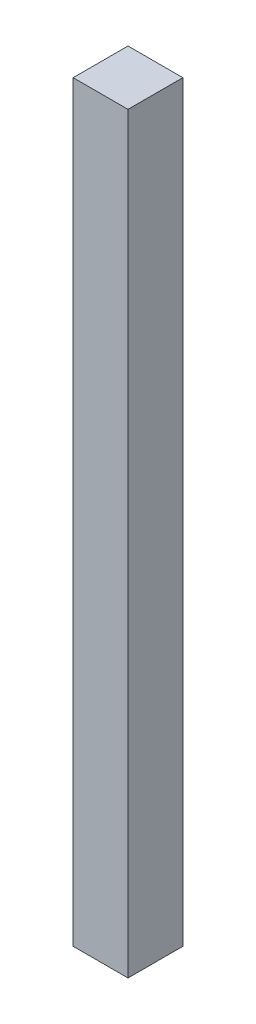
ISO-10303-21;
HEADER;
FILE_DESCRIPTION(('STEP AP214'),'2;1');
FILE_NAME('part.step','',(''),(''),'','','');
FILE_SCHEMA(('AUTOMOTIVE_DESIGN { 1 0 10303 214 1 1 1 1 }'));
ENDSEC;
DATA;
#1=APPLICATION_CONTEXT('core data for automotive mechanical design processes');
#2=APPLICATION_PROTOCOL_DEFINITION('international standard','automotive_design',2000,#1);
#3=PRODUCT_CONTEXT('',#1,'mechanical');
#4=PRODUCT('Part','Part','',(#3));
#5=PRODUCT_RELATED_PRODUCT_CATEGORY('part','',(#4));
#6=PRODUCT_DEFINITION_FORMATION('','',#4);
#7=PRODUCT_DEFINITION_CONTEXT('part definition',#1,'design');
#8=PRODUCT_DEFINITION('design','',#6,#7);
#9=PRODUCT_DEFINITION_SHAPE('','',#8);
#10=(LENGTH_UNIT() NAMED_UNIT(*) SI_UNIT(.MILLI.,.METRE.));
#11=(NAMED_UNIT(*) PLANE_ANGLE_UNIT() SI_UNIT($,.RADIAN.));
#12=(NAMED_UNIT(*) SI_UNIT($,.STERADIAN.) SOLID_ANGLE_UNIT());
#13=UNCERTAINTY_MEASURE_WITH_UNIT(LENGTH_MEASURE(1.E-05),#10,'distance_accuracy_value','');
#14=(GEOMETRIC_REPRESENTATION_CONTEXT(3) GLOBAL_UNCERTAINTY_ASSIGNED_CONTEXT((#13)) GLOBAL_UNIT_ASSIGNED_CONTEXT((#10,
#11,#12)) REPRESENTATION_CONTEXT('',''));
#15=CARTESIAN_POINT('',(0.,0.,0.));
#16=DIRECTION('',(0.,0.,1.));
#17=DIRECTION('',(1.,0.,0.));
#18=AXIS2_PLACEMENT_3D('',#15,#16,#17);
#19=CARTESIAN_POINT('',(0.,-1219.2,88.9));
#20=DIRECTION('',(1.,0.,0.));
#21=DIRECTION('',(0.,0.,-1.));
#22=AXIS2_PLACEMENT_3D('',#19,#20,#21);
#23=PLANE('',#22);
#24=DIRECTION('',(0.,0.,-1.));
#25=VECTOR('',#24,1.);
#26=CARTESIAN_POINT('',(0.,0.,88.9));
#27=LINE('',#26,#25);
#28=CARTESIAN_POINT('',(0.,0.,88.9));
#29=VERTEX_POINT('',#28);
#30=CARTESIAN_POINT('',(0.,0.,0.));
#31=VERTEX_POINT('',#30);
#32=EDGE_CURVE('E100',#29,#31,#27,.T.);
#33=ORIENTED_EDGE('',*,*,#32,.F.);
#34=DIRECTION('',(0.,1.,0.));
#35=VECTOR('',#34,1.);
#36=CARTESIAN_POINT('',(0.,-1219.2,88.9));
#37=LINE('',#36,#35);
#38=CARTESIAN_POINT('',(0.,-1219.2,88.9));
#39=VERTEX_POINT('',#38);
#40=EDGE_CURVE('E11',#39,#29,#37,.T.);
#41=ORIENTED_EDGE('',*,*,#40,.F.);
#42=DIRECTION('',(0.,0.,-1.));
#43=VECTOR('',#42,1.);
#44=CARTESIAN_POINT('',(0.,-1219.2,88.9));
#45=LINE('',#44,#43);
#46=CARTESIAN_POINT('',(0.,-1219.2,0.));
#47=VERTEX_POINT('',#46);
#48=EDGE_CURVE('E94',#39,#47,#45,.T.);
#49=ORIENTED_EDGE('',*,*,#48,.T.);
#50=DIRECTION('',(0.,1.,0.));
#51=VECTOR('',#50,1.);
#52=CARTESIAN_POINT('',(0.,-1219.2,0.));
#53=LINE('',#52,#51);
#54=EDGE_CURVE('E39',#47,#31,#53,.T.);
#55=ORIENTED_EDGE('',*,*,#54,.T.);
#56=EDGE_LOOP('',(#33,#41,#49,#55));
#57=FACE_BOUND('',#56,.T.);
#58=ADVANCED_FACE('F36',(#57),#23,.T.);
#59=CARTESIAN_POINT('',(-88.9,-1219.2,88.9));
#60=DIRECTION('',(0.,0.,1.));
#61=DIRECTION('',(1.,0.,0.));
#62=AXIS2_PLACEMENT_3D('',#59,#60,#61);
#63=PLANE('',#62);
#64=DIRECTION('',(1.,0.,0.));
#65=VECTOR('',#64,1.);
#66=CARTESIAN_POINT('',(-88.9,0.,88.9));
#67=LINE('',#66,#65);
#68=CARTESIAN_POINT('',(-88.9,0.,88.9));
#69=VERTEX_POINT('',#68);
#70=EDGE_CURVE('E96',#69,#29,#67,.T.);
#71=ORIENTED_EDGE('',*,*,#70,.F.);
#72=DIRECTION('',(0.,1.,0.));
#73=VECTOR('',#72,1.);
#74=CARTESIAN_POINT('',(-88.9,-1219.2,88.9));
#75=LINE('',#74,#73);
#76=CARTESIAN_POINT('',(-88.9,-1219.2,88.9));
#77=VERTEX_POINT('',#76);
#78=EDGE_CURVE('E45',#77,#69,#75,.T.);
#79=ORIENTED_EDGE('',*,*,#78,.F.);
#80=DIRECTION('',(1.,0.,0.));
#81=VECTOR('',#80,1.);
#82=CARTESIAN_POINT('',(-88.9,-1219.2,88.9));
#83=LINE('',#82,#81);
#84=EDGE_CURVE('E91',#77,#39,#83,.T.);
#85=ORIENTED_EDGE('',*,*,#84,.T.);
#86=ORIENTED_EDGE('',*,*,#40,.T.);
#87=EDGE_LOOP('',(#71,#79,#85,#86));
#88=FACE_BOUND('',#87,.T.);
#89=ADVANCED_FACE('F110',(#88),#63,.T.);
#90=CARTESIAN_POINT('',(-88.9,-1219.2,0.));
#91=DIRECTION('',(-1.,0.,0.));
#92=DIRECTION('',(0.,0.,1.));
#93=AXIS2_PLACEMENT_3D('',#90,#91,#92);
#94=PLANE('',#93);
#95=DIRECTION('',(0.,0.,1.));
#96=VECTOR('',#95,1.);
#97=CARTESIAN_POINT('',(-88.9,0.,0.));
#98=LINE('',#97,#96);
#99=CARTESIAN_POINT('',(-88.9,0.,0.));
#100=VERTEX_POINT('',#99);
#101=EDGE_CURVE('E86',#100,#69,#98,.T.);
#102=ORIENTED_EDGE('',*,*,#101,.F.);
#103=DIRECTION('',(0.,1.,0.));
#104=VECTOR('',#103,1.);
#105=CARTESIAN_POINT('',(-88.9,-1219.2,0.));
#106=LINE('',#105,#104);
#107=CARTESIAN_POINT('',(-88.9,-1219.2,0.));
#108=VERTEX_POINT('',#107);
#109=EDGE_CURVE('E81',#108,#100,#106,.T.);
#110=ORIENTED_EDGE('',*,*,#109,.F.);
#111=DIRECTION('',(0.,0.,1.));
#112=VECTOR('',#111,1.);
#113=CARTESIAN_POINT('',(-88.9,-1219.2,0.));
#114=LINE('',#113,#112);
#115=EDGE_CURVE('E84',#108,#77,#114,.T.);
#116=ORIENTED_EDGE('',*,*,#115,.T.);
#117=ORIENTED_EDGE('',*,*,#78,.T.);
#118=EDGE_LOOP('',(#102,#110,#116,#117));
#119=FACE_BOUND('',#118,.T.);
#120=ADVANCED_FACE('F83',(#119),#94,.T.);
#121=CARTESIAN_POINT('',(0.,-1219.2,0.));
#122=DIRECTION('',(0.,0.,-1.));
#123=DIRECTION('',(-1.,0.,0.));
#124=AXIS2_PLACEMENT_3D('',#121,#122,#123);
#125=PLANE('',#124);
#126=DIRECTION('',(-1.,0.,0.));
#127=VECTOR('',#126,1.);
#128=CARTESIAN_POINT('',(0.,0.,0.));
#129=LINE('',#128,#127);
#130=EDGE_CURVE('E103',#31,#100,#129,.T.);
#131=ORIENTED_EDGE('',*,*,#130,.F.);
#132=ORIENTED_EDGE('',*,*,#54,.F.);
#133=DIRECTION('',(-1.,0.,0.));
#134=VECTOR('',#133,1.);
#135=CARTESIAN_POINT('',(0.,-1219.2,0.));
#136=LINE('',#135,#134);
#137=EDGE_CURVE('E90',#47,#108,#136,.T.);
#138=ORIENTED_EDGE('',*,*,#137,.T.);
#139=ORIENTED_EDGE('',*,*,#109,.T.);
#140=EDGE_LOOP('',(#131,#132,#138,#139));
#141=FACE_BOUND('',#140,.T.);
#142=ADVANCED_FACE('F93',(#141),#125,.T.);
#143=CARTESIAN_POINT('',(0.,-1219.2,0.));
#144=DIRECTION('',(0.,1.,0.));
#145=DIRECTION('',(0.,0.,1.));
#146=AXIS2_PLACEMENT_3D('',#143,#144,#145);
#147=PLANE('',#146);
#148=ORIENTED_EDGE('',*,*,#48,.F.);
#149=ORIENTED_EDGE('',*,*,#84,.F.);
#150=ORIENTED_EDGE('',*,*,#115,.F.);
#151=ORIENTED_EDGE('',*,*,#137,.F.);
#152=EDGE_LOOP('',(#148,#149,#150,#151));
#153=FACE_BOUND('',#152,.T.);
#154=ADVANCED_FACE('F89',(#153),#147,.F.);
#155=CARTESIAN_POINT('',(0.,0.,0.));
#156=DIRECTION('',(0.,1.,0.));
#157=DIRECTION('',(0.,0.,1.));
#158=AXIS2_PLACEMENT_3D('',#155,#156,#157);
#159=PLANE('',#158);
#160=ORIENTED_EDGE('',*,*,#32,.T.);
#161=ORIENTED_EDGE('',*,*,#130,.T.);
#162=ORIENTED_EDGE('',*,*,#101,.T.);
#163=ORIENTED_EDGE('',*,*,#70,.T.);
#164=EDGE_LOOP('',(#160,#161,#162,#163));
#165=FACE_BOUND('',#164,.T.);
#166=ADVANCED_FACE('F109',(#165),#159,.T.);
#167=CLOSED_SHELL('',(#58,#89,#120,#142,#154,#166));
#168=MANIFOLD_SOLID_BREP('B2',#167);
#169=ADVANCED_BREP_SHAPE_REPRESENTATION('',(#18,#168),#14);
#170=SHAPE_DEFINITION_REPRESENTATION(#9,#169);
ENDSEC;
END-ISO-10303-21;
